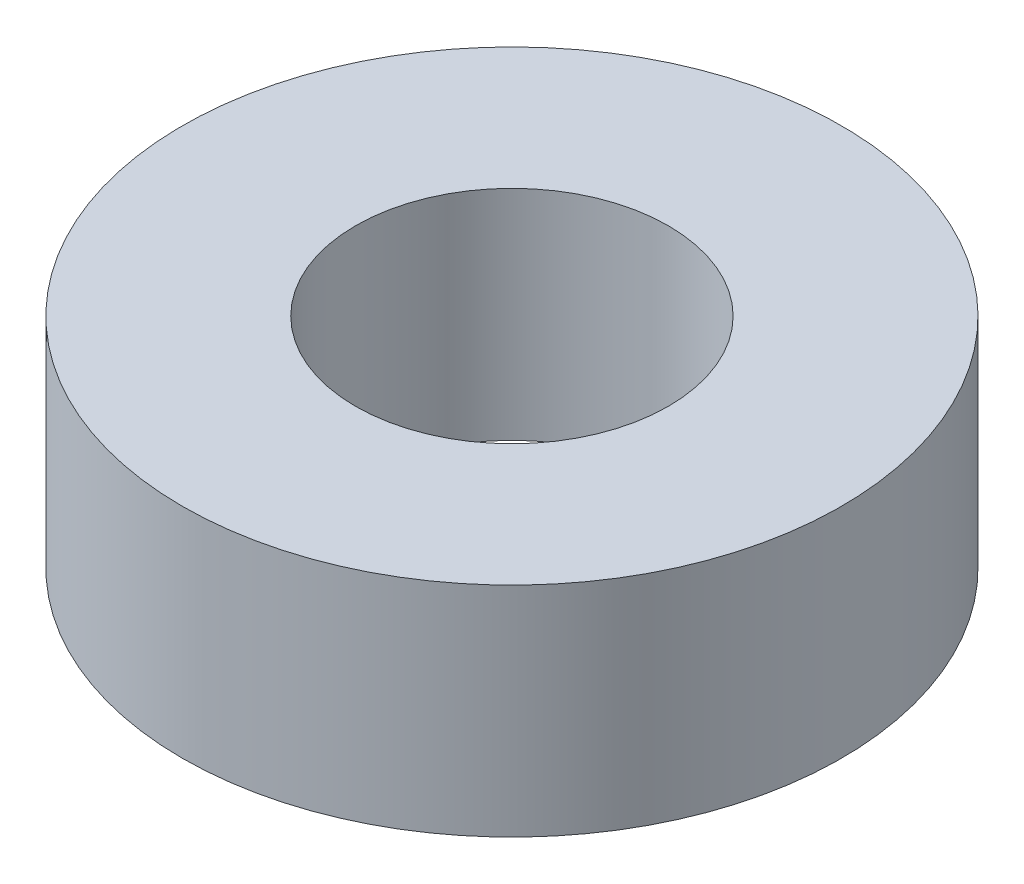
ISO-10303-21;
HEADER;
FILE_DESCRIPTION(('STEP AP214'),'2;1');
FILE_NAME('part.step','',(''),(''),'','','');
FILE_SCHEMA(('AUTOMOTIVE_DESIGN { 1 0 10303 214 1 1 1 1 }'));
ENDSEC;
DATA;
#1=APPLICATION_CONTEXT('core data for automotive mechanical design processes');
#2=APPLICATION_PROTOCOL_DEFINITION('international standard','automotive_design',2000,#1);
#3=PRODUCT_CONTEXT('',#1,'mechanical');
#4=PRODUCT('Part','Part','',(#3));
#5=PRODUCT_RELATED_PRODUCT_CATEGORY('part','',(#4));
#6=PRODUCT_DEFINITION_FORMATION('','',#4);
#7=PRODUCT_DEFINITION_CONTEXT('part definition',#1,'design');
#8=PRODUCT_DEFINITION('design','',#6,#7);
#9=PRODUCT_DEFINITION_SHAPE('','',#8);
#10=(LENGTH_UNIT() NAMED_UNIT(*) SI_UNIT(.MILLI.,.METRE.));
#11=(NAMED_UNIT(*) PLANE_ANGLE_UNIT() SI_UNIT($,.RADIAN.));
#12=(NAMED_UNIT(*) SI_UNIT($,.STERADIAN.) SOLID_ANGLE_UNIT());
#13=UNCERTAINTY_MEASURE_WITH_UNIT(LENGTH_MEASURE(1.E-05),#10,'distance_accuracy_value','');
#14=(GEOMETRIC_REPRESENTATION_CONTEXT(3) GLOBAL_UNCERTAINTY_ASSIGNED_CONTEXT((#13)) GLOBAL_UNIT_ASSIGNED_CONTEXT((#10,
#11,#12)) REPRESENTATION_CONTEXT('',''));
#15=CARTESIAN_POINT('',(0.,0.,0.));
#16=DIRECTION('',(0.,0.,1.));
#17=DIRECTION('',(1.,0.,0.));
#18=AXIS2_PLACEMENT_3D('',#15,#16,#17);
#19=CARTESIAN_POINT('',(0.,15.,0.));
#20=DIRECTION('',(0.,1.,0.));
#21=DIRECTION('',(0.,0.,1.));
#22=AXIS2_PLACEMENT_3D('',#19,#20,#21);
#23=PLANE('',#22);
#24=CARTESIAN_POINT('',(0.,15.,0.));
#25=DIRECTION('',(0.,1.,0.));
#26=DIRECTION('',(0.,0.,1.));
#27=AXIS2_PLACEMENT_3D('',#24,#25,#26);
#28=CIRCLE('',#27,22.65);
#29=CARTESIAN_POINT('',(0.,15.,22.65));
#30=VERTEX_POINT('',#29);
#31=EDGE_CURVE('E10',#30,#30,#28,.T.);
#32=ORIENTED_EDGE('',*,*,#31,.T.);
#33=EDGE_LOOP('',(#32));
#34=FACE_BOUND('',#33,.T.);
#35=CARTESIAN_POINT('',(0.,15.,0.));
#36=DIRECTION('',(0.,1.,0.));
#37=DIRECTION('',(0.,0.,1.));
#38=AXIS2_PLACEMENT_3D('',#35,#36,#37);
#39=CIRCLE('',#38,10.75);
#40=CARTESIAN_POINT('',(0.,15.,10.75));
#41=VERTEX_POINT('',#40);
#42=EDGE_CURVE('E42',#41,#41,#39,.T.);
#43=ORIENTED_EDGE('',*,*,#42,.F.);
#44=EDGE_LOOP('',(#43));
#45=FACE_BOUND('',#44,.T.);
#46=ADVANCED_FACE('F31',(#34,#45),#23,.T.);
#47=CARTESIAN_POINT('',(0.,0.,0.));
#48=DIRECTION('',(0.,1.,0.));
#49=DIRECTION('',(0.,0.,1.));
#50=AXIS2_PLACEMENT_3D('',#47,#48,#49);
#51=PLANE('',#50);
#52=CARTESIAN_POINT('',(0.,0.,0.));
#53=DIRECTION('',(0.,1.,0.));
#54=DIRECTION('',(0.,0.,1.));
#55=AXIS2_PLACEMENT_3D('',#52,#53,#54);
#56=CIRCLE('',#55,22.65);
#57=CARTESIAN_POINT('',(0.,0.,22.65));
#58=VERTEX_POINT('',#57);
#59=EDGE_CURVE('E35',#58,#58,#56,.T.);
#60=ORIENTED_EDGE('',*,*,#59,.F.);
#61=EDGE_LOOP('',(#60));
#62=FACE_BOUND('',#61,.T.);
#63=CARTESIAN_POINT('',(0.,0.,0.));
#64=DIRECTION('',(0.,1.,0.));
#65=DIRECTION('',(0.,0.,1.));
#66=AXIS2_PLACEMENT_3D('',#63,#64,#65);
#67=CIRCLE('',#66,10.75);
#68=CARTESIAN_POINT('',(0.,0.,10.75));
#69=VERTEX_POINT('',#68);
#70=EDGE_CURVE('E44',#69,#69,#67,.T.);
#71=ORIENTED_EDGE('',*,*,#70,.T.);
#72=EDGE_LOOP('',(#71));
#73=FACE_BOUND('',#72,.T.);
#74=ADVANCED_FACE('F54',(#62,#73),#51,.F.);
#75=CARTESIAN_POINT('',(0.,15.,0.));
#76=DIRECTION('',(0.,-1.,0.));
#77=DIRECTION('',(0.,0.,-1.));
#78=AXIS2_PLACEMENT_3D('',#75,#76,#77);
#79=CYLINDRICAL_SURFACE('',#78,22.65);
#80=ORIENTED_EDGE('',*,*,#31,.F.);
#81=EDGE_LOOP('',(#80));
#82=FACE_BOUND('',#81,.T.);
#83=ORIENTED_EDGE('',*,*,#59,.T.);
#84=EDGE_LOOP('',(#83));
#85=FACE_BOUND('',#84,.T.);
#86=ADVANCED_FACE('F33',(#82,#85),#79,.T.);
#87=CARTESIAN_POINT('',(0.,15.,0.));
#88=DIRECTION('',(0.,-1.,0.));
#89=DIRECTION('',(0.,0.,-1.));
#90=AXIS2_PLACEMENT_3D('',#87,#88,#89);
#91=CYLINDRICAL_SURFACE('',#90,10.75);
#92=ORIENTED_EDGE('',*,*,#42,.T.);
#93=EDGE_LOOP('',(#92));
#94=FACE_BOUND('',#93,.T.);
#95=ORIENTED_EDGE('',*,*,#70,.F.);
#96=EDGE_LOOP('',(#95));
#97=FACE_BOUND('',#96,.T.);
#98=ADVANCED_FACE('F50',(#94,#97),#91,.F.);
#99=CLOSED_SHELL('',(#46,#74,#86,#98));
#100=MANIFOLD_SOLID_BREP('B2',#99);
#101=ADVANCED_BREP_SHAPE_REPRESENTATION('',(#18,#100),#14);
#102=SHAPE_DEFINITION_REPRESENTATION(#9,#101);
ENDSEC;
END-ISO-10303-21;
